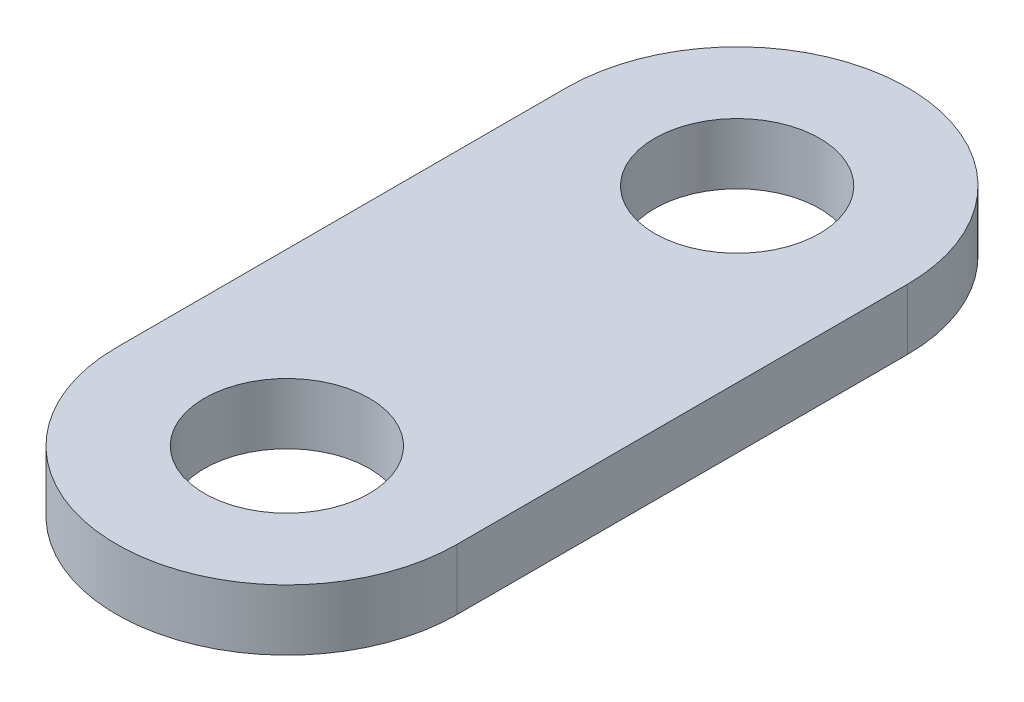
ISO-10303-21;
HEADER;
FILE_DESCRIPTION(('STEP AP214'),'2;1');
FILE_NAME('part.step','',(''),(''),'','','');
FILE_SCHEMA(('AUTOMOTIVE_DESIGN { 1 0 10303 214 1 1 1 1 }'));
ENDSEC;
DATA;
#1=APPLICATION_CONTEXT('core data for automotive mechanical design processes');
#2=APPLICATION_PROTOCOL_DEFINITION('international standard','automotive_design',2000,#1);
#3=PRODUCT_CONTEXT('',#1,'mechanical');
#4=PRODUCT('Part','Part','',(#3));
#5=PRODUCT_RELATED_PRODUCT_CATEGORY('part','',(#4));
#6=PRODUCT_DEFINITION_FORMATION('','',#4);
#7=PRODUCT_DEFINITION_CONTEXT('part definition',#1,'design');
#8=PRODUCT_DEFINITION('design','',#6,#7);
#9=PRODUCT_DEFINITION_SHAPE('','',#8);
#10=(LENGTH_UNIT() NAMED_UNIT(*) SI_UNIT(.MILLI.,.METRE.));
#11=(NAMED_UNIT(*) PLANE_ANGLE_UNIT() SI_UNIT($,.RADIAN.));
#12=(NAMED_UNIT(*) SI_UNIT($,.STERADIAN.) SOLID_ANGLE_UNIT());
#13=UNCERTAINTY_MEASURE_WITH_UNIT(LENGTH_MEASURE(1.E-05),#10,'distance_accuracy_value','');
#14=(GEOMETRIC_REPRESENTATION_CONTEXT(3) GLOBAL_UNCERTAINTY_ASSIGNED_CONTEXT((#13)) GLOBAL_UNIT_ASSIGNED_CONTEXT((#10,
#11,#12)) REPRESENTATION_CONTEXT('',''));
#15=CARTESIAN_POINT('',(0.,0.,0.));
#16=DIRECTION('',(0.,0.,1.));
#17=DIRECTION('',(1.,0.,0.));
#18=AXIS2_PLACEMENT_3D('',#15,#16,#17);
#19=CARTESIAN_POINT('',(0.,1.5875,-5.83815972138481));
#20=DIRECTION('',(0.,-1.,0.));
#21=DIRECTION('',(0.,0.,-1.));
#22=AXIS2_PLACEMENT_3D('',#19,#20,#21);
#23=PLANE('',#22);
#24=CARTESIAN_POINT('',(0.,1.5875,-5.83815972138481));
#25=DIRECTION('',(0.,1.,0.));
#26=DIRECTION('',(0.,0.,-1.));
#27=AXIS2_PLACEMENT_3D('',#24,#25,#26);
#28=CIRCLE('',#27,4.445);
#29=CARTESIAN_POINT('',(4.445,1.5875,-5.83815972138481));
#30=VERTEX_POINT('',#29);
#31=CARTESIAN_POINT('',(-4.445,1.5875,-5.8381597213848));
#32=VERTEX_POINT('',#31);
#33=EDGE_CURVE('E92',#30,#32,#28,.T.);
#34=ORIENTED_EDGE('',*,*,#33,.T.);
#35=DIRECTION('',(0.,0.,1.));
#36=VECTOR('',#35,1.);
#37=CARTESIAN_POINT('',(-4.445,1.5875,-5.8381597213848));
#38=LINE('',#37,#36);
#39=CARTESIAN_POINT('',(-4.445,1.5875,5.90934027861518));
#40=VERTEX_POINT('',#39);
#41=EDGE_CURVE('E87',#32,#40,#38,.T.);
#42=ORIENTED_EDGE('',*,*,#41,.T.);
#43=CARTESIAN_POINT('',(0.,1.5875,5.90934027861519));
#44=DIRECTION('',(0.,1.,0.));
#45=DIRECTION('',(0.,0.,1.));
#46=AXIS2_PLACEMENT_3D('',#43,#44,#45);
#47=CIRCLE('',#46,4.445);
#48=CARTESIAN_POINT('',(4.445,1.5875,5.90934027861519));
#49=VERTEX_POINT('',#48);
#50=EDGE_CURVE('E90',#40,#49,#47,.T.);
#51=ORIENTED_EDGE('',*,*,#50,.T.);
#52=DIRECTION('',(0.,0.,-1.));
#53=VECTOR('',#52,1.);
#54=CARTESIAN_POINT('',(4.445,1.5875,-5.83815972138481));
#55=LINE('',#54,#53);
#56=EDGE_CURVE('E57',#49,#30,#55,.T.);
#57=ORIENTED_EDGE('',*,*,#56,.T.);
#58=EDGE_LOOP('',(#34,#42,#51,#57));
#59=FACE_BOUND('',#58,.T.);
#60=CARTESIAN_POINT('',(0.,1.5875,5.90934027861519));
#61=DIRECTION('',(0.,1.,0.));
#62=DIRECTION('',(0.,0.,-1.));
#63=AXIS2_PLACEMENT_3D('',#60,#61,#62);
#64=CIRCLE('',#63,2.15265);
#65=CARTESIAN_POINT('',(0.,1.5875,3.75669027861519));
#66=VERTEX_POINT('',#65);
#67=EDGE_CURVE('E112',#66,#66,#64,.T.);
#68=ORIENTED_EDGE('',*,*,#67,.F.);
#69=EDGE_LOOP('',(#68));
#70=FACE_BOUND('',#69,.T.);
#71=CARTESIAN_POINT('',(0.,1.5875,-5.83815972138481));
#72=DIRECTION('',(0.,1.,0.));
#73=DIRECTION('',(0.,0.,1.));
#74=AXIS2_PLACEMENT_3D('',#71,#72,#73);
#75=CIRCLE('',#74,2.15265);
#76=CARTESIAN_POINT('',(0.,1.5875,-3.68550972138481));
#77=VERTEX_POINT('',#76);
#78=EDGE_CURVE('E134',#77,#77,#75,.T.);
#79=ORIENTED_EDGE('',*,*,#78,.F.);
#80=EDGE_LOOP('',(#79));
#81=FACE_BOUND('',#80,.T.);
#82=ADVANCED_FACE('F39',(#59,#70,#81),#23,.F.);
#83=CARTESIAN_POINT('',(0.,0.,-5.83815972138481));
#84=DIRECTION('',(0.,-1.,0.));
#85=DIRECTION('',(0.,0.,-1.));
#86=AXIS2_PLACEMENT_3D('',#83,#84,#85);
#87=PLANE('',#86);
#88=CARTESIAN_POINT('',(0.,0.,5.90934027861519));
#89=DIRECTION('',(0.,1.,0.));
#90=DIRECTION('',(0.,0.,-1.));
#91=AXIS2_PLACEMENT_3D('',#88,#89,#90);
#92=CIRCLE('',#91,2.15265);
#93=CARTESIAN_POINT('',(0.,0.,3.75669027861519));
#94=VERTEX_POINT('',#93);
#95=EDGE_CURVE('E130',#94,#94,#92,.T.);
#96=ORIENTED_EDGE('',*,*,#95,.T.);
#97=EDGE_LOOP('',(#96));
#98=FACE_BOUND('',#97,.T.);
#99=CARTESIAN_POINT('',(0.,0.,-5.83815972138481));
#100=DIRECTION('',(0.,1.,0.));
#101=DIRECTION('',(0.,0.,-1.));
#102=AXIS2_PLACEMENT_3D('',#99,#100,#101);
#103=CIRCLE('',#102,4.445);
#104=CARTESIAN_POINT('',(4.445,0.,-5.83815972138481));
#105=VERTEX_POINT('',#104);
#106=CARTESIAN_POINT('',(-4.445,0.,-5.8381597213848));
#107=VERTEX_POINT('',#106);
#108=EDGE_CURVE('E108',#105,#107,#103,.T.);
#109=ORIENTED_EDGE('',*,*,#108,.F.);
#110=DIRECTION('',(0.,0.,-1.));
#111=VECTOR('',#110,1.);
#112=CARTESIAN_POINT('',(4.445,0.,-5.83815972138481));
#113=LINE('',#112,#111);
#114=CARTESIAN_POINT('',(4.445,0.,5.90934027861519));
#115=VERTEX_POINT('',#114);
#116=EDGE_CURVE('E80',#115,#105,#113,.T.);
#117=ORIENTED_EDGE('',*,*,#116,.F.);
#118=CARTESIAN_POINT('',(0.,0.,5.90934027861519));
#119=DIRECTION('',(0.,1.,0.));
#120=DIRECTION('',(0.,0.,1.));
#121=AXIS2_PLACEMENT_3D('',#118,#119,#120);
#122=CIRCLE('',#121,4.445);
#123=CARTESIAN_POINT('',(-4.445,0.,5.90934027861518));
#124=VERTEX_POINT('',#123);
#125=EDGE_CURVE('E74',#124,#115,#122,.T.);
#126=ORIENTED_EDGE('',*,*,#125,.F.);
#127=DIRECTION('',(0.,0.,1.));
#128=VECTOR('',#127,1.);
#129=CARTESIAN_POINT('',(-4.445,0.,-5.8381597213848));
#130=LINE('',#129,#128);
#131=EDGE_CURVE('E97',#107,#124,#130,.T.);
#132=ORIENTED_EDGE('',*,*,#131,.F.);
#133=EDGE_LOOP('',(#109,#117,#126,#132));
#134=FACE_BOUND('',#133,.T.);
#135=CARTESIAN_POINT('',(0.,0.,-5.83815972138481));
#136=DIRECTION('',(0.,1.,0.));
#137=DIRECTION('',(0.,0.,1.));
#138=AXIS2_PLACEMENT_3D('',#135,#136,#137);
#139=CIRCLE('',#138,2.15265);
#140=CARTESIAN_POINT('',(0.,0.,-3.68550972138481));
#141=VERTEX_POINT('',#140);
#142=EDGE_CURVE('E138',#141,#141,#139,.T.);
#143=ORIENTED_EDGE('',*,*,#142,.T.);
#144=EDGE_LOOP('',(#143));
#145=FACE_BOUND('',#144,.T.);
#146=ADVANCED_FACE('F125',(#98,#134,#145),#87,.T.);
#147=CARTESIAN_POINT('',(0.,1.5875,-5.83815972138481));
#148=DIRECTION('',(0.,-1.,0.));
#149=DIRECTION('',(0.,0.,-1.));
#150=AXIS2_PLACEMENT_3D('',#147,#148,#149);
#151=CYLINDRICAL_SURFACE('',#150,4.445);
#152=ORIENTED_EDGE('',*,*,#108,.T.);
#153=DIRECTION('',(0.,-1.,0.));
#154=VECTOR('',#153,1.);
#155=CARTESIAN_POINT('',(-4.445,1.5875,-5.8381597213848));
#156=LINE('',#155,#154);
#157=EDGE_CURVE('E11',#32,#107,#156,.T.);
#158=ORIENTED_EDGE('',*,*,#157,.F.);
#159=ORIENTED_EDGE('',*,*,#33,.F.);
#160=DIRECTION('',(0.,-1.,0.));
#161=VECTOR('',#160,1.);
#162=CARTESIAN_POINT('',(4.445,1.5875,-5.83815972138481));
#163=LINE('',#162,#161);
#164=EDGE_CURVE('E104',#30,#105,#163,.T.);
#165=ORIENTED_EDGE('',*,*,#164,.T.);
#166=EDGE_LOOP('',(#152,#158,#159,#165));
#167=FACE_BOUND('',#166,.T.);
#168=ADVANCED_FACE('F41',(#167),#151,.T.);
#169=CARTESIAN_POINT('',(-4.445,1.5875,-5.8381597213848));
#170=DIRECTION('',(1.,0.,0.));
#171=DIRECTION('',(0.,0.,-1.));
#172=AXIS2_PLACEMENT_3D('',#169,#170,#171);
#173=PLANE('',#172);
#174=ORIENTED_EDGE('',*,*,#131,.T.);
#175=DIRECTION('',(0.,-1.,0.));
#176=VECTOR('',#175,1.);
#177=CARTESIAN_POINT('',(-4.445,1.5875,5.90934027861518));
#178=LINE('',#177,#176);
#179=EDGE_CURVE('E49',#40,#124,#178,.T.);
#180=ORIENTED_EDGE('',*,*,#179,.F.);
#181=ORIENTED_EDGE('',*,*,#41,.F.);
#182=ORIENTED_EDGE('',*,*,#157,.T.);
#183=EDGE_LOOP('',(#174,#180,#181,#182));
#184=FACE_BOUND('',#183,.T.);
#185=ADVANCED_FACE('F96',(#184),#173,.F.);
#186=CARTESIAN_POINT('',(0.,1.5875,5.90934027861519));
#187=DIRECTION('',(0.,-1.,0.));
#188=DIRECTION('',(0.,0.,-1.));
#189=AXIS2_PLACEMENT_3D('',#186,#187,#188);
#190=CYLINDRICAL_SURFACE('',#189,4.445);
#191=ORIENTED_EDGE('',*,*,#125,.T.);
#192=DIRECTION('',(0.,-1.,0.));
#193=VECTOR('',#192,1.);
#194=CARTESIAN_POINT('',(4.445,1.5875,5.90934027861519));
#195=LINE('',#194,#193);
#196=EDGE_CURVE('E99',#49,#115,#195,.T.);
#197=ORIENTED_EDGE('',*,*,#196,.F.);
#198=ORIENTED_EDGE('',*,*,#50,.F.);
#199=ORIENTED_EDGE('',*,*,#179,.T.);
#200=EDGE_LOOP('',(#191,#197,#198,#199));
#201=FACE_BOUND('',#200,.T.);
#202=ADVANCED_FACE('F100',(#201),#190,.T.);
#203=CARTESIAN_POINT('',(4.445,1.5875,-5.83815972138481));
#204=DIRECTION('',(-1.,0.,0.));
#205=DIRECTION('',(0.,0.,1.));
#206=AXIS2_PLACEMENT_3D('',#203,#204,#205);
#207=PLANE('',#206);
#208=ORIENTED_EDGE('',*,*,#116,.T.);
#209=ORIENTED_EDGE('',*,*,#164,.F.);
#210=ORIENTED_EDGE('',*,*,#56,.F.);
#211=ORIENTED_EDGE('',*,*,#196,.T.);
#212=EDGE_LOOP('',(#208,#209,#210,#211));
#213=FACE_BOUND('',#212,.T.);
#214=ADVANCED_FACE('F122',(#213),#207,.F.);
#215=CARTESIAN_POINT('',(0.,1.5875,5.90934027861519));
#216=DIRECTION('',(0.,-1.,0.));
#217=DIRECTION('',(0.,0.,-1.));
#218=AXIS2_PLACEMENT_3D('',#215,#216,#217);
#219=CYLINDRICAL_SURFACE('',#218,2.15265);
#220=ORIENTED_EDGE('',*,*,#67,.T.);
#221=EDGE_LOOP('',(#220));
#222=FACE_BOUND('',#221,.T.);
#223=ORIENTED_EDGE('',*,*,#95,.F.);
#224=EDGE_LOOP('',(#223));
#225=FACE_BOUND('',#224,.T.);
#226=ADVANCED_FACE('F157',(#222,#225),#219,.F.);
#227=CARTESIAN_POINT('',(0.,1.5875,-5.83815972138481));
#228=DIRECTION('',(0.,-1.,0.));
#229=DIRECTION('',(0.,0.,-1.));
#230=AXIS2_PLACEMENT_3D('',#227,#228,#229);
#231=CYLINDRICAL_SURFACE('',#230,2.15265);
#232=ORIENTED_EDGE('',*,*,#78,.T.);
#233=EDGE_LOOP('',(#232));
#234=FACE_BOUND('',#233,.T.);
#235=ORIENTED_EDGE('',*,*,#142,.F.);
#236=EDGE_LOOP('',(#235));
#237=FACE_BOUND('',#236,.T.);
#238=ADVANCED_FACE('F146',(#234,#237),#231,.F.);
#239=CLOSED_SHELL('',(#82,#146,#168,#185,#202,#214,#226,#238));
#240=MANIFOLD_SOLID_BREP('B2',#239);
#241=ADVANCED_BREP_SHAPE_REPRESENTATION('',(#18,#240),#14);
#242=SHAPE_DEFINITION_REPRESENTATION(#9,#241);
ENDSEC;
END-ISO-10303-21;
